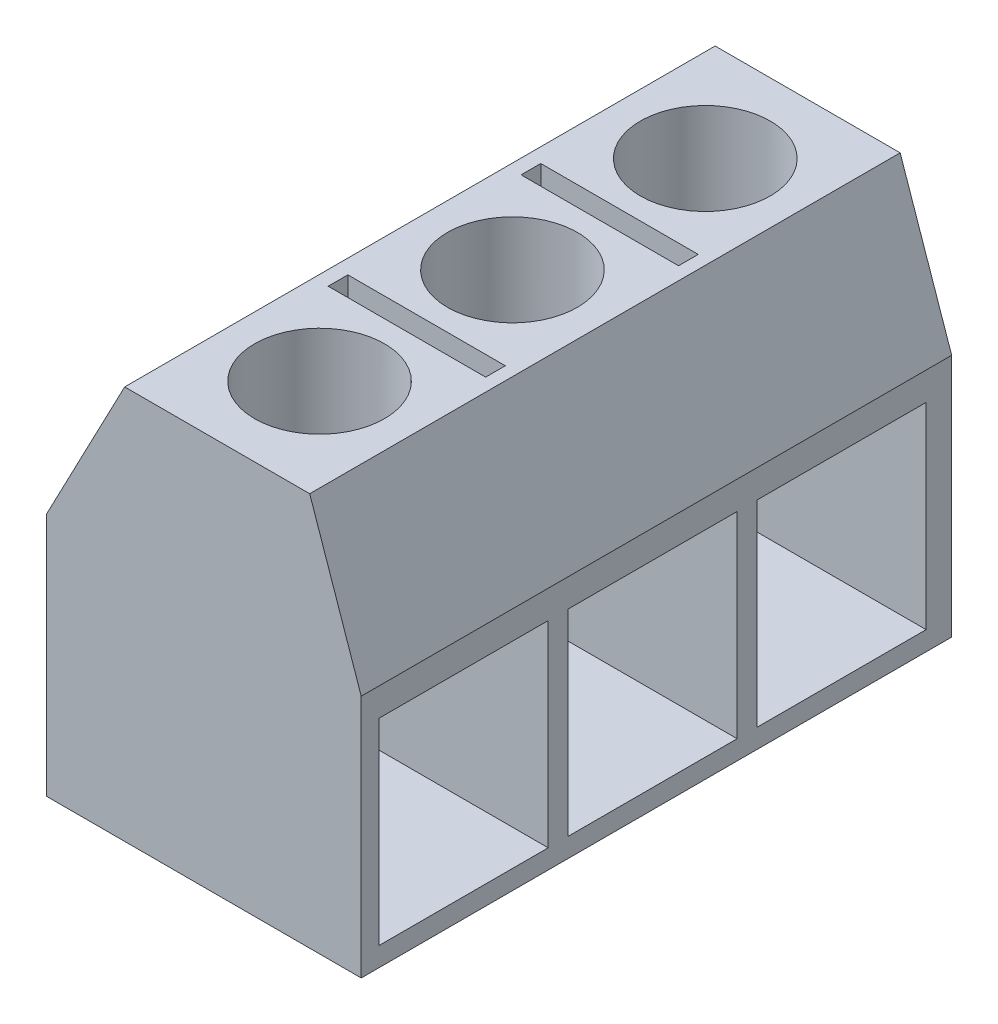
ISO-10303-21;
HEADER;
FILE_DESCRIPTION(('STEP AP214'),'2;1');
FILE_NAME('part.step','',(''),(''),'','','');
FILE_SCHEMA(('AUTOMOTIVE_DESIGN { 1 0 10303 214 1 1 1 1 }'));
ENDSEC;
DATA;
#1=APPLICATION_CONTEXT('core data for automotive mechanical design processes');
#2=APPLICATION_PROTOCOL_DEFINITION('international standard','automotive_design',2000,#1);
#3=PRODUCT_CONTEXT('',#1,'mechanical');
#4=PRODUCT('Part','Part','',(#3));
#5=PRODUCT_RELATED_PRODUCT_CATEGORY('part','',(#4));
#6=PRODUCT_DEFINITION_FORMATION('','',#4);
#7=PRODUCT_DEFINITION_CONTEXT('part definition',#1,'design');
#8=PRODUCT_DEFINITION('design','',#6,#7);
#9=PRODUCT_DEFINITION_SHAPE('','',#8);
#10=(LENGTH_UNIT() NAMED_UNIT(*) SI_UNIT(.MILLI.,.METRE.));
#11=(NAMED_UNIT(*) PLANE_ANGLE_UNIT() SI_UNIT($,.RADIAN.));
#12=(NAMED_UNIT(*) SI_UNIT($,.STERADIAN.) SOLID_ANGLE_UNIT());
#13=UNCERTAINTY_MEASURE_WITH_UNIT(LENGTH_MEASURE(1.E-05),#10,'distance_accuracy_value','');
#14=(GEOMETRIC_REPRESENTATION_CONTEXT(3) GLOBAL_UNCERTAINTY_ASSIGNED_CONTEXT((#13)) GLOBAL_UNIT_ASSIGNED_CONTEXT((#10,
#11,#12)) REPRESENTATION_CONTEXT('',''));
#15=CARTESIAN_POINT('',(0.,0.,0.));
#16=DIRECTION('',(0.,0.,1.));
#17=DIRECTION('',(1.,0.,0.));
#18=AXIS2_PLACEMENT_3D('',#15,#16,#17);
#19=CARTESIAN_POINT('',(-355.835743374389,0.,15.));
#20=DIRECTION('',(-1.,0.,0.));
#21=DIRECTION('',(0.,0.,1.));
#22=AXIS2_PLACEMENT_3D('',#19,#20,#21);
#23=PLANE('',#22);
#24=DIRECTION('',(0.,-1.,0.));
#25=VECTOR('',#24,1.);
#26=CARTESIAN_POINT('',(-355.835743374389,0.,5.45));
#27=LINE('',#26,#25);
#28=CARTESIAN_POINT('',(-355.835743374389,5.48900518216399,5.45));
#29=VERTEX_POINT('',#28);
#30=CARTESIAN_POINT('',(-355.835743374389,0.489005182163993,5.45));
#31=VERTEX_POINT('',#30);
#32=EDGE_CURVE('E63',#29,#31,#27,.T.);
#33=ORIENTED_EDGE('',*,*,#32,.T.);
#34=DIRECTION('',(0.,0.,-1.));
#35=VECTOR('',#34,1.);
#36=CARTESIAN_POINT('',(-355.835743374389,0.489005182163993,0.));
#37=LINE('',#36,#35);
#38=CARTESIAN_POINT('',(-355.835743374389,0.489005182163993,9.75));
#39=VERTEX_POINT('',#38);
#40=EDGE_CURVE('E294',#39,#31,#37,.T.);
#41=ORIENTED_EDGE('',*,*,#40,.F.);
#42=DIRECTION('',(0.,-1.,0.));
#43=VECTOR('',#42,1.);
#44=CARTESIAN_POINT('',(-355.835743374389,0.,9.75));
#45=LINE('',#44,#43);
#46=CARTESIAN_POINT('',(-355.835743374389,5.48900518216399,9.75));
#47=VERTEX_POINT('',#46);
#48=EDGE_CURVE('E313',#47,#39,#45,.T.);
#49=ORIENTED_EDGE('',*,*,#48,.F.);
#50=DIRECTION('',(0.,0.,-1.));
#51=VECTOR('',#50,1.);
#52=CARTESIAN_POINT('',(-355.835743374389,5.48900518216399,0.));
#53=LINE('',#52,#51);
#54=EDGE_CURVE('E308',#47,#29,#53,.T.);
#55=ORIENTED_EDGE('',*,*,#54,.T.);
#56=EDGE_LOOP('',(#33,#41,#49,#55));
#57=FACE_BOUND('',#56,.T.);
#58=DIRECTION('',(0.,1.,0.));
#59=VECTOR('',#58,1.);
#60=CARTESIAN_POINT('',(-355.835743374389,0.,0.));
#61=LINE('',#60,#59);
#62=CARTESIAN_POINT('',(-355.835743374389,0.,0.));
#63=VERTEX_POINT('',#62);
#64=CARTESIAN_POINT('',(-355.835743374389,6.19999999999998,0.));
#65=VERTEX_POINT('',#64);
#66=EDGE_CURVE('E529',#63,#65,#61,.T.);
#67=ORIENTED_EDGE('',*,*,#66,.T.);
#68=DIRECTION('',(0.,0.,-1.));
#69=VECTOR('',#68,1.);
#70=CARTESIAN_POINT('',(-355.835743374389,6.19999999999998,15.));
#71=LINE('',#70,#69);
#72=CARTESIAN_POINT('',(-355.835743374389,6.19999999999998,15.));
#73=VERTEX_POINT('',#72);
#74=EDGE_CURVE('E551',#73,#65,#71,.T.);
#75=ORIENTED_EDGE('',*,*,#74,.F.);
#76=DIRECTION('',(0.,1.,0.));
#77=VECTOR('',#76,1.);
#78=CARTESIAN_POINT('',(-355.835743374389,0.,15.));
#79=LINE('',#78,#77);
#80=CARTESIAN_POINT('',(-355.835743374389,0.,15.));
#81=VERTEX_POINT('',#80);
#82=EDGE_CURVE('E510',#81,#73,#79,.T.);
#83=ORIENTED_EDGE('',*,*,#82,.F.);
#84=DIRECTION('',(0.,0.,-1.));
#85=VECTOR('',#84,1.);
#86=CARTESIAN_POINT('',(-355.835743374389,0.,15.));
#87=LINE('',#86,#85);
#88=EDGE_CURVE('E555',#81,#63,#87,.T.);
#89=ORIENTED_EDGE('',*,*,#88,.T.);
#90=EDGE_LOOP('',(#67,#75,#83,#89));
#91=FACE_BOUND('',#90,.T.);
#92=DIRECTION('',(0.,-1.,0.));
#93=VECTOR('',#92,1.);
#94=CARTESIAN_POINT('',(-355.835743374389,0.,0.649999999999999));
#95=LINE('',#94,#93);
#96=CARTESIAN_POINT('',(-355.835743374389,5.48900518216399,0.650000000000001));
#97=VERTEX_POINT('',#96);
#98=CARTESIAN_POINT('',(-355.835743374389,0.489005182163993,0.65));
#99=VERTEX_POINT('',#98);
#100=EDGE_CURVE('E348',#97,#99,#95,.T.);
#101=ORIENTED_EDGE('',*,*,#100,.T.);
#102=DIRECTION('',(0.,0.,-1.));
#103=VECTOR('',#102,1.);
#104=CARTESIAN_POINT('',(-355.835743374389,0.489005182163993,0.));
#105=LINE('',#104,#103);
#106=CARTESIAN_POINT('',(-355.835743374389,0.489005182163993,4.95));
#107=VERTEX_POINT('',#106);
#108=EDGE_CURVE('E336',#107,#99,#105,.T.);
#109=ORIENTED_EDGE('',*,*,#108,.F.);
#110=DIRECTION('',(0.,-1.,0.));
#111=VECTOR('',#110,1.);
#112=CARTESIAN_POINT('',(-355.835743374389,0.,4.95));
#113=LINE('',#112,#111);
#114=CARTESIAN_POINT('',(-355.835743374389,5.48900518216399,4.95));
#115=VERTEX_POINT('',#114);
#116=EDGE_CURVE('E356',#115,#107,#113,.T.);
#117=ORIENTED_EDGE('',*,*,#116,.F.);
#118=DIRECTION('',(0.,0.,-1.));
#119=VECTOR('',#118,1.);
#120=CARTESIAN_POINT('',(-355.835743374389,5.48900518216399,0.));
#121=LINE('',#120,#119);
#122=EDGE_CURVE('E352',#115,#97,#121,.T.);
#123=ORIENTED_EDGE('',*,*,#122,.T.);
#124=EDGE_LOOP('',(#101,#109,#117,#123));
#125=FACE_BOUND('',#124,.T.);
#126=DIRECTION('',(0.,-1.,0.));
#127=VECTOR('',#126,1.);
#128=CARTESIAN_POINT('',(-355.835743374389,0.,10.25));
#129=LINE('',#128,#127);
#130=CARTESIAN_POINT('',(-355.835743374389,5.48900518216399,10.25));
#131=VERTEX_POINT('',#130);
#132=CARTESIAN_POINT('',(-355.835743374389,0.489005182163993,10.25));
#133=VERTEX_POINT('',#132);
#134=EDGE_CURVE('E55',#131,#133,#129,.T.);
#135=ORIENTED_EDGE('',*,*,#134,.T.);
#136=DIRECTION('',(0.,0.,-1.));
#137=VECTOR('',#136,1.);
#138=CARTESIAN_POINT('',(-355.835743374389,0.489005182163993,0.));
#139=LINE('',#138,#137);
#140=CARTESIAN_POINT('',(-355.835743374389,0.489005182163993,14.55));
#141=VERTEX_POINT('',#140);
#142=EDGE_CURVE('E261',#141,#133,#139,.T.);
#143=ORIENTED_EDGE('',*,*,#142,.F.);
#144=DIRECTION('',(0.,-1.,0.));
#145=VECTOR('',#144,1.);
#146=CARTESIAN_POINT('',(-355.835743374389,0.,14.55));
#147=LINE('',#146,#145);
#148=CARTESIAN_POINT('',(-355.835743374389,5.48900518216399,14.55));
#149=VERTEX_POINT('',#148);
#150=EDGE_CURVE('E265',#149,#141,#147,.T.);
#151=ORIENTED_EDGE('',*,*,#150,.F.);
#152=DIRECTION('',(0.,0.,-1.));
#153=VECTOR('',#152,1.);
#154=CARTESIAN_POINT('',(-355.835743374389,5.489005182164,0.));
#155=LINE('',#154,#153);
#156=EDGE_CURVE('E274',#149,#131,#155,.T.);
#157=ORIENTED_EDGE('',*,*,#156,.T.);
#158=EDGE_LOOP('',(#135,#143,#151,#157));
#159=FACE_BOUND('',#158,.T.);
#160=ADVANCED_FACE('F39',(#57,#91,#125,#159),#23,.F.);
#161=CARTESIAN_POINT('',(-357.47498496997,0.8,9.7));
#162=DIRECTION('',(0.,0.,-1.));
#163=DIRECTION('',(-1.,0.,0.));
#164=AXIS2_PLACEMENT_3D('',#161,#162,#163);
#165=PLANE('',#164);
#166=DIRECTION('',(-1.,0.,0.));
#167=VECTOR('',#166,1.);
#168=CARTESIAN_POINT('',(-357.47498496997,5.48900518216399,9.7));
#169=LINE('',#168,#167);
#170=CARTESIAN_POINT('',(-357.47498496997,5.48900518216399,9.7));
#171=VERTEX_POINT('',#170);
#172=CARTESIAN_POINT('',(-361.47498496997,5.48900518216399,9.7));
#173=VERTEX_POINT('',#172);
#174=EDGE_CURVE('E394',#171,#173,#169,.T.);
#175=ORIENTED_EDGE('',*,*,#174,.F.);
#176=DIRECTION('',(0.,1.,0.));
#177=VECTOR('',#176,1.);
#178=CARTESIAN_POINT('',(-357.47498496997,0.8,9.7));
#179=LINE('',#178,#177);
#180=CARTESIAN_POINT('',(-357.47498496997,9.99999999999992,9.7));
#181=VERTEX_POINT('',#180);
#182=EDGE_CURVE('E465',#171,#181,#179,.T.);
#183=ORIENTED_EDGE('',*,*,#182,.T.);
#184=DIRECTION('',(-1.,0.,0.));
#185=VECTOR('',#184,1.);
#186=CARTESIAN_POINT('',(-357.47498496997,10.,9.7));
#187=LINE('',#186,#185);
#188=CARTESIAN_POINT('',(-361.47498496997,10.,9.7));
#189=VERTEX_POINT('',#188);
#190=EDGE_CURVE('E486',#181,#189,#187,.T.);
#191=ORIENTED_EDGE('',*,*,#190,.T.);
#192=DIRECTION('',(0.,1.,0.));
#193=VECTOR('',#192,1.);
#194=CARTESIAN_POINT('',(-361.47498496997,0.8,9.7));
#195=LINE('',#194,#193);
#196=EDGE_CURVE('E469',#173,#189,#195,.T.);
#197=ORIENTED_EDGE('',*,*,#196,.F.);
#198=EDGE_LOOP('',(#175,#183,#191,#197));
#199=FACE_BOUND('',#198,.T.);
#200=ADVANCED_FACE('F577',(#199),#165,.F.);
#201=CARTESIAN_POINT('',(-359.494738602923,0.8,12.4));
#202=DIRECTION('',(0.,1.,0.));
#203=DIRECTION('',(0.,0.,1.));
#204=AXIS2_PLACEMENT_3D('',#201,#202,#203);
#205=CYLINDRICAL_SURFACE('',#204,1.64999999999999);
#206=CARTESIAN_POINT('',(-359.494738602923,10.,12.4));
#207=DIRECTION('',(0.,1.,0.));
#208=DIRECTION('',(0.,0.,1.));
#209=AXIS2_PLACEMENT_3D('',#206,#207,#208);
#210=CIRCLE('',#209,1.64999999999999);
#211=CARTESIAN_POINT('',(-359.494738602923,10.,14.05));
#212=VERTEX_POINT('',#211);
#213=EDGE_CURVE('E460',#212,#212,#210,.T.);
#214=ORIENTED_EDGE('',*,*,#213,.T.);
#215=EDGE_LOOP('',(#214));
#216=FACE_BOUND('',#215,.T.);
#217=CARTESIAN_POINT('',(-359.494738602923,5.48900518216399,12.4));
#218=DIRECTION('',(0.,-1.,0.));
#219=DIRECTION('',(0.,0.,-1.));
#220=AXIS2_PLACEMENT_3D('',#217,#218,#219);
#221=CIRCLE('',#220,1.64999999999999);
#222=CARTESIAN_POINT('',(-359.494738602923,5.48900518216399,10.75));
#223=VERTEX_POINT('',#222);
#224=EDGE_CURVE('E404',#223,#223,#221,.F.);
#225=ORIENTED_EDGE('',*,*,#224,.F.);
#226=EDGE_LOOP('',(#225));
#227=FACE_BOUND('',#226,.T.);
#228=ADVANCED_FACE('F574',(#216,#227),#205,.F.);
#229=CARTESIAN_POINT('',(-359.494738602923,0.8,7.5));
#230=DIRECTION('',(0.,1.,0.));
#231=DIRECTION('',(0.,0.,1.));
#232=AXIS2_PLACEMENT_3D('',#229,#230,#231);
#233=CYLINDRICAL_SURFACE('',#232,1.64999999999999);
#234=CARTESIAN_POINT('',(-359.494738602923,10.,7.5));
#235=DIRECTION('',(0.,1.,0.));
#236=DIRECTION('',(0.,0.,1.));
#237=AXIS2_PLACEMENT_3D('',#234,#235,#236);
#238=CIRCLE('',#237,1.64999999999999);
#239=CARTESIAN_POINT('',(-359.494738602923,10.,9.14999999999999));
#240=VERTEX_POINT('',#239);
#241=EDGE_CURVE('E432',#240,#240,#238,.F.);
#242=ORIENTED_EDGE('',*,*,#241,.F.);
#243=EDGE_LOOP('',(#242));
#244=FACE_BOUND('',#243,.T.);
#245=CARTESIAN_POINT('',(-359.494738602923,5.48900518216399,7.5));
#246=DIRECTION('',(0.,-1.,0.));
#247=DIRECTION('',(0.,0.,-1.));
#248=AXIS2_PLACEMENT_3D('',#245,#246,#247);
#249=CIRCLE('',#248,1.64999999999999);
#250=CARTESIAN_POINT('',(-359.494738602923,5.48900518216399,5.85000000000001));
#251=VERTEX_POINT('',#250);
#252=EDGE_CURVE('E393',#251,#251,#249,.T.);
#253=ORIENTED_EDGE('',*,*,#252,.T.);
#254=EDGE_LOOP('',(#253));
#255=FACE_BOUND('',#254,.T.);
#256=ADVANCED_FACE('F576',(#244,#255),#233,.F.);
#257=CARTESIAN_POINT('',(0.,0.8,4.79999999999992));
#258=DIRECTION('',(0.,0.,-1.));
#259=DIRECTION('',(-1.,0.,0.));
#260=AXIS2_PLACEMENT_3D('',#257,#258,#259);
#261=PLANE('',#260);
#262=DIRECTION('',(-1.,0.,0.));
#263=VECTOR('',#262,1.);
#264=CARTESIAN_POINT('',(0.,5.48900518216399,4.79999999999992));
#265=LINE('',#264,#263);
#266=CARTESIAN_POINT('',(-357.47498496997,5.48900518216399,4.8));
#267=VERTEX_POINT('',#266);
#268=CARTESIAN_POINT('',(-361.47498496997,5.48900518216399,4.8));
#269=VERTEX_POINT('',#268);
#270=EDGE_CURVE('E379',#267,#269,#265,.T.);
#271=ORIENTED_EDGE('',*,*,#270,.F.);
#272=DIRECTION('',(0.,1.,0.));
#273=VECTOR('',#272,1.);
#274=CARTESIAN_POINT('',(-357.47498496997,0.8,4.8));
#275=LINE('',#274,#273);
#276=CARTESIAN_POINT('',(-357.47498496997,10.,4.8));
#277=VERTEX_POINT('',#276);
#278=EDGE_CURVE('E429',#267,#277,#275,.T.);
#279=ORIENTED_EDGE('',*,*,#278,.T.);
#280=DIRECTION('',(-1.,0.,0.));
#281=VECTOR('',#280,1.);
#282=CARTESIAN_POINT('',(0.,10.,4.79999999999992));
#283=LINE('',#282,#281);
#284=CARTESIAN_POINT('',(-361.47498496997,9.99999999999992,4.8));
#285=VERTEX_POINT('',#284);
#286=EDGE_CURVE('E418',#277,#285,#283,.T.);
#287=ORIENTED_EDGE('',*,*,#286,.T.);
#288=DIRECTION('',(0.,1.,0.));
#289=VECTOR('',#288,1.);
#290=CARTESIAN_POINT('',(-361.47498496997,0.8,4.8));
#291=LINE('',#290,#289);
#292=EDGE_CURVE('E419',#269,#285,#291,.T.);
#293=ORIENTED_EDGE('',*,*,#292,.F.);
#294=EDGE_LOOP('',(#271,#279,#287,#293));
#295=FACE_BOUND('',#294,.T.);
#296=ADVANCED_FACE('F584',(#295),#261,.F.);
#297=CARTESIAN_POINT('',(-359.494738602923,0.8,2.6));
#298=DIRECTION('',(0.,1.,0.));
#299=DIRECTION('',(0.,0.,1.));
#300=AXIS2_PLACEMENT_3D('',#297,#298,#299);
#301=CYLINDRICAL_SURFACE('',#300,1.64999999999999);
#302=CARTESIAN_POINT('',(-359.494738602923,10.,2.6));
#303=DIRECTION('',(0.,1.,0.));
#304=DIRECTION('',(0.,0.,1.));
#305=AXIS2_PLACEMENT_3D('',#302,#303,#304);
#306=CIRCLE('',#305,1.64999999999999);
#307=CARTESIAN_POINT('',(-359.494738602923,10.,4.24999999999999));
#308=VERTEX_POINT('',#307);
#309=EDGE_CURVE('E413',#308,#308,#306,.T.);
#310=ORIENTED_EDGE('',*,*,#309,.T.);
#311=EDGE_LOOP('',(#310));
#312=FACE_BOUND('',#311,.T.);
#313=CARTESIAN_POINT('',(-359.494738602923,5.48900518216399,2.6));
#314=DIRECTION('',(0.,-1.,0.));
#315=DIRECTION('',(0.,0.,-1.));
#316=AXIS2_PLACEMENT_3D('',#313,#314,#315);
#317=CIRCLE('',#316,1.64999999999999);
#318=CARTESIAN_POINT('',(-359.494738602923,5.48900518216399,0.950000000000013));
#319=VERTEX_POINT('',#318);
#320=EDGE_CURVE('E284',#319,#319,#317,.F.);
#321=ORIENTED_EDGE('',*,*,#320,.F.);
#322=EDGE_LOOP('',(#321));
#323=FACE_BOUND('',#322,.T.);
#324=ADVANCED_FACE('F642',(#312,#323),#301,.F.);
#325=CARTESIAN_POINT('',(-357.144738602923,9.99999999999992,15.));
#326=DIRECTION('',(0.,-1.,0.));
#327=DIRECTION('',(1.,0.,0.));
#328=AXIS2_PLACEMENT_3D('',#325,#326,#327);
#329=PLANE('',#328);
#330=ORIENTED_EDGE('',*,*,#309,.F.);
#331=EDGE_LOOP('',(#330));
#332=FACE_BOUND('',#331,.T.);
#333=DIRECTION('',(0.,0.,1.));
#334=VECTOR('',#333,1.);
#335=CARTESIAN_POINT('',(-361.47498496997,10.,0.));
#336=LINE('',#335,#334);
#337=CARTESIAN_POINT('',(-361.47498496997,10.,5.3));
#338=VERTEX_POINT('',#337);
#339=EDGE_CURVE('E442',#285,#338,#336,.T.);
#340=ORIENTED_EDGE('',*,*,#339,.F.);
#341=ORIENTED_EDGE('',*,*,#286,.F.);
#342=DIRECTION('',(0.,0.,1.));
#343=VECTOR('',#342,1.);
#344=CARTESIAN_POINT('',(-357.47498496997,10.,0.));
#345=LINE('',#344,#343);
#346=CARTESIAN_POINT('',(-357.47498496997,10.,5.3));
#347=VERTEX_POINT('',#346);
#348=EDGE_CURVE('E433',#277,#347,#345,.T.);
#349=ORIENTED_EDGE('',*,*,#348,.T.);
#350=DIRECTION('',(-1.,0.,0.));
#351=VECTOR('',#350,1.);
#352=CARTESIAN_POINT('',(0.,10.,5.29999999999992));
#353=LINE('',#352,#351);
#354=EDGE_CURVE('E437',#347,#338,#353,.T.);
#355=ORIENTED_EDGE('',*,*,#354,.T.);
#356=EDGE_LOOP('',(#340,#341,#349,#355));
#357=FACE_BOUND('',#356,.T.);
#358=ORIENTED_EDGE('',*,*,#213,.F.);
#359=EDGE_LOOP('',(#358));
#360=FACE_BOUND('',#359,.T.);
#361=ORIENTED_EDGE('',*,*,#190,.F.);
#362=DIRECTION('',(0.,0.,-1.));
#363=VECTOR('',#362,1.);
#364=CARTESIAN_POINT('',(-357.47498496997,10.,10.2));
#365=LINE('',#364,#363);
#366=CARTESIAN_POINT('',(-357.47498496997,10.,10.2));
#367=VERTEX_POINT('',#366);
#368=EDGE_CURVE('E464',#367,#181,#365,.T.);
#369=ORIENTED_EDGE('',*,*,#368,.F.);
#370=DIRECTION('',(-1.,0.,0.));
#371=VECTOR('',#370,1.);
#372=CARTESIAN_POINT('',(-357.47498496997,10.,10.2));
#373=LINE('',#372,#371);
#374=CARTESIAN_POINT('',(-361.47498496997,10.,10.2));
#375=VERTEX_POINT('',#374);
#376=EDGE_CURVE('E477',#367,#375,#373,.T.);
#377=ORIENTED_EDGE('',*,*,#376,.T.);
#378=DIRECTION('',(0.,0.,-1.));
#379=VECTOR('',#378,1.);
#380=CARTESIAN_POINT('',(-361.47498496997,10.,10.2));
#381=LINE('',#380,#379);
#382=EDGE_CURVE('E481',#375,#189,#381,.T.);
#383=ORIENTED_EDGE('',*,*,#382,.T.);
#384=EDGE_LOOP('',(#361,#369,#377,#383));
#385=FACE_BOUND('',#384,.T.);
#386=DIRECTION('',(-1.,0.,0.));
#387=VECTOR('',#386,1.);
#388=CARTESIAN_POINT('',(-357.144738602923,9.99999999999992,0.));
#389=LINE('',#388,#387);
#390=CARTESIAN_POINT('',(-357.144738602923,9.99999999999992,0.));
#391=VERTEX_POINT('',#390);
#392=CARTESIAN_POINT('',(-361.844738602923,9.99999999999992,0.));
#393=VERTEX_POINT('',#392);
#394=EDGE_CURVE('E535',#391,#393,#389,.T.);
#395=ORIENTED_EDGE('',*,*,#394,.T.);
#396=DIRECTION('',(0.,0.,-1.));
#397=VECTOR('',#396,1.);
#398=CARTESIAN_POINT('',(-361.844738602923,9.99999999999992,15.));
#399=LINE('',#398,#397);
#400=CARTESIAN_POINT('',(-361.844738602923,9.99999999999992,15.));
#401=VERTEX_POINT('',#400);
#402=EDGE_CURVE('E543',#401,#393,#399,.T.);
#403=ORIENTED_EDGE('',*,*,#402,.F.);
#404=DIRECTION('',(-1.,0.,0.));
#405=VECTOR('',#404,1.);
#406=CARTESIAN_POINT('',(-357.144738602923,9.99999999999992,15.));
#407=LINE('',#406,#405);
#408=CARTESIAN_POINT('',(-357.144738602923,9.99999999999992,15.));
#409=VERTEX_POINT('',#408);
#410=EDGE_CURVE('E516',#409,#401,#407,.T.);
#411=ORIENTED_EDGE('',*,*,#410,.F.);
#412=DIRECTION('',(0.,0.,-1.));
#413=VECTOR('',#412,1.);
#414=CARTESIAN_POINT('',(-357.144738602923,9.99999999999992,15.));
#415=LINE('',#414,#413);
#416=EDGE_CURVE('E547',#409,#391,#415,.T.);
#417=ORIENTED_EDGE('',*,*,#416,.T.);
#418=EDGE_LOOP('',(#395,#403,#411,#417));
#419=FACE_BOUND('',#418,.T.);
#420=ORIENTED_EDGE('',*,*,#241,.T.);
#421=EDGE_LOOP('',(#420));
#422=FACE_BOUND('',#421,.T.);
#423=ADVANCED_FACE('F608',(#332,#357,#360,#385,#419,#422),#329,.F.);
#424=CARTESIAN_POINT('',(-363.835743374389,6.19999999999998,15.));
#425=DIRECTION('',(1.,0.,0.));
#426=DIRECTION('',(0.,1.,0.));
#427=AXIS2_PLACEMENT_3D('',#424,#425,#426);
#428=PLANE('',#427);
#429=DIRECTION('',(0.,-1.,0.));
#430=VECTOR('',#429,1.);
#431=CARTESIAN_POINT('',(-363.835743374389,6.19999999999998,0.));
#432=LINE('',#431,#430);
#433=CARTESIAN_POINT('',(-363.835743374389,6.19999999999998,0.));
#434=VERTEX_POINT('',#433);
#435=CARTESIAN_POINT('',(-363.835743374389,0.,0.));
#436=VERTEX_POINT('',#435);
#437=EDGE_CURVE('E417',#434,#436,#432,.T.);
#438=ORIENTED_EDGE('',*,*,#437,.T.);
#439=DIRECTION('',(0.,0.,-1.));
#440=VECTOR('',#439,1.);
#441=CARTESIAN_POINT('',(-363.835743374389,0.,15.));
#442=LINE('',#441,#440);
#443=CARTESIAN_POINT('',(-363.835743374389,0.,15.));
#444=VERTEX_POINT('',#443);
#445=EDGE_CURVE('E559',#444,#436,#442,.T.);
#446=ORIENTED_EDGE('',*,*,#445,.F.);
#447=DIRECTION('',(0.,-1.,0.));
#448=VECTOR('',#447,1.);
#449=CARTESIAN_POINT('',(-363.835743374389,6.19999999999998,15.));
#450=LINE('',#449,#448);
#451=CARTESIAN_POINT('',(-363.835743374389,6.19999999999998,15.));
#452=VERTEX_POINT('',#451);
#453=EDGE_CURVE('E502',#452,#444,#450,.T.);
#454=ORIENTED_EDGE('',*,*,#453,.F.);
#455=DIRECTION('',(0.,0.,-1.));
#456=VECTOR('',#455,1.);
#457=CARTESIAN_POINT('',(-363.835743374389,6.19999999999998,15.));
#458=LINE('',#457,#456);
#459=EDGE_CURVE('E522',#452,#434,#458,.T.);
#460=ORIENTED_EDGE('',*,*,#459,.T.);
#461=EDGE_LOOP('',(#438,#446,#454,#460));
#462=FACE_BOUND('',#461,.T.);
#463=ADVANCED_FACE('F41',(#462),#428,.F.);
#464=CARTESIAN_POINT('',(-363.835743374389,0.,15.));
#465=DIRECTION('',(0.,1.,0.));
#466=DIRECTION('',(0.,0.,1.));
#467=AXIS2_PLACEMENT_3D('',#464,#465,#466);
#468=PLANE('',#467);
#469=DIRECTION('',(1.,0.,0.));
#470=VECTOR('',#469,1.);
#471=CARTESIAN_POINT('',(-363.835743374389,0.,0.));
#472=LINE('',#471,#470);
#473=EDGE_CURVE('E526',#436,#63,#472,.T.);
#474=ORIENTED_EDGE('',*,*,#473,.T.);
#475=ORIENTED_EDGE('',*,*,#88,.F.);
#476=DIRECTION('',(1.,0.,0.));
#477=VECTOR('',#476,1.);
#478=CARTESIAN_POINT('',(-363.835743374389,0.,15.));
#479=LINE('',#478,#477);
#480=EDGE_CURVE('E506',#444,#81,#479,.T.);
#481=ORIENTED_EDGE('',*,*,#480,.F.);
#482=ORIENTED_EDGE('',*,*,#445,.T.);
#483=EDGE_LOOP('',(#474,#475,#481,#482));
#484=FACE_BOUND('',#483,.T.);
#485=ADVANCED_FACE('F599',(#484),#468,.F.);
#486=CARTESIAN_POINT('',(-355.835743374389,6.19999999999998,15.));
#487=DIRECTION('',(-0.945476419668404,-0.325690558430875,0.));
#488=DIRECTION('',(0.325690558430875,-0.945476419668405,0.));
#489=AXIS2_PLACEMENT_3D('',#486,#487,#488);
#490=PLANE('',#489);
#491=DIRECTION('',(-0.325690558430875,0.945476419668404,0.));
#492=VECTOR('',#491,1.);
#493=CARTESIAN_POINT('',(-355.835743374389,6.19999999999998,0.));
#494=LINE('',#493,#492);
#495=EDGE_CURVE('E532',#65,#391,#494,.T.);
#496=ORIENTED_EDGE('',*,*,#495,.T.);
#497=ORIENTED_EDGE('',*,*,#416,.F.);
#498=DIRECTION('',(-0.325690558430875,0.945476419668404,0.));
#499=VECTOR('',#498,1.);
#500=CARTESIAN_POINT('',(-355.835743374389,6.19999999999998,15.));
#501=LINE('',#500,#499);
#502=EDGE_CURVE('E513',#73,#409,#501,.T.);
#503=ORIENTED_EDGE('',*,*,#502,.F.);
#504=ORIENTED_EDGE('',*,*,#74,.T.);
#505=EDGE_LOOP('',(#496,#497,#503,#504));
#506=FACE_BOUND('',#505,.T.);
#507=ADVANCED_FACE('F597',(#506),#490,.F.);
#508=CARTESIAN_POINT('',(-361.844738602923,9.99999999999992,15.));
#509=DIRECTION('',(0.885780885780871,-0.464103676332406,0.));
#510=DIRECTION('',(0.464103676332406,0.885780885780872,0.));
#511=AXIS2_PLACEMENT_3D('',#508,#509,#510);
#512=PLANE('',#511);
#513=DIRECTION('',(-0.464103676332406,-0.885780885780872,0.));
#514=VECTOR('',#513,1.);
#515=CARTESIAN_POINT('',(-361.844738602923,9.99999999999992,0.));
#516=LINE('',#515,#514);
#517=EDGE_CURVE('E507',#393,#434,#516,.T.);
#518=ORIENTED_EDGE('',*,*,#517,.T.);
#519=ORIENTED_EDGE('',*,*,#459,.F.);
#520=DIRECTION('',(-0.464103676332406,-0.885780885780872,0.));
#521=VECTOR('',#520,1.);
#522=CARTESIAN_POINT('',(-361.844738602923,9.99999999999992,15.));
#523=LINE('',#522,#521);
#524=EDGE_CURVE('E519',#401,#452,#523,.T.);
#525=ORIENTED_EDGE('',*,*,#524,.F.);
#526=ORIENTED_EDGE('',*,*,#402,.T.);
#527=EDGE_LOOP('',(#518,#519,#525,#526));
#528=FACE_BOUND('',#527,.T.);
#529=ADVANCED_FACE('F606',(#528),#512,.F.);
#530=CARTESIAN_POINT('',(0.,0.,15.));
#531=DIRECTION('',(0.,0.,1.));
#532=DIRECTION('',(1.,0.,0.));
#533=AXIS2_PLACEMENT_3D('',#530,#531,#532);
#534=PLANE('',#533);
#535=ORIENTED_EDGE('',*,*,#453,.T.);
#536=ORIENTED_EDGE('',*,*,#480,.T.);
#537=ORIENTED_EDGE('',*,*,#82,.T.);
#538=ORIENTED_EDGE('',*,*,#502,.T.);
#539=ORIENTED_EDGE('',*,*,#410,.T.);
#540=ORIENTED_EDGE('',*,*,#524,.T.);
#541=EDGE_LOOP('',(#535,#536,#537,#538,#539,#540));
#542=FACE_BOUND('',#541,.T.);
#543=ADVANCED_FACE('F630',(#542),#534,.T.);
#544=CARTESIAN_POINT('',(0.,0.,0.));
#545=DIRECTION('',(0.,0.,1.));
#546=DIRECTION('',(1.,0.,0.));
#547=AXIS2_PLACEMENT_3D('',#544,#545,#546);
#548=PLANE('',#547);
#549=ORIENTED_EDGE('',*,*,#437,.F.);
#550=ORIENTED_EDGE('',*,*,#517,.F.);
#551=ORIENTED_EDGE('',*,*,#394,.F.);
#552=ORIENTED_EDGE('',*,*,#495,.F.);
#553=ORIENTED_EDGE('',*,*,#66,.F.);
#554=ORIENTED_EDGE('',*,*,#473,.F.);
#555=EDGE_LOOP('',(#549,#550,#551,#552,#553,#554));
#556=FACE_BOUND('',#555,.T.);
#557=ADVANCED_FACE('F619',(#556),#548,.F.);
#558=CARTESIAN_POINT('',(-357.47498496997,0.8,10.2));
#559=DIRECTION('',(1.,0.,0.));
#560=DIRECTION('',(0.,0.,-1.));
#561=AXIS2_PLACEMENT_3D('',#558,#559,#560);
#562=PLANE('',#561);
#563=DIRECTION('',(0.,0.,-1.));
#564=VECTOR('',#563,1.);
#565=CARTESIAN_POINT('',(-357.47498496997,5.48900518216399,10.2));
#566=LINE('',#565,#564);
#567=CARTESIAN_POINT('',(-357.47498496997,5.48900518216399,9.75));
#568=VERTEX_POINT('',#567);
#569=EDGE_CURVE('E401',#568,#171,#566,.T.);
#570=ORIENTED_EDGE('',*,*,#569,.F.);
#571=DIRECTION('',(0.,-1.,0.));
#572=VECTOR('',#571,1.);
#573=CARTESIAN_POINT('',(-357.47498496997,0.8,9.75));
#574=LINE('',#573,#572);
#575=CARTESIAN_POINT('',(-357.47498496997,0.8,9.75));
#576=VERTEX_POINT('',#575);
#577=EDGE_CURVE('E408',#568,#576,#574,.T.);
#578=ORIENTED_EDGE('',*,*,#577,.T.);
#579=DIRECTION('',(0.,0.,-1.));
#580=VECTOR('',#579,1.);
#581=CARTESIAN_POINT('',(-357.47498496997,0.8,10.2));
#582=LINE('',#581,#580);
#583=CARTESIAN_POINT('',(-357.47498496997,0.8,10.2));
#584=VERTEX_POINT('',#583);
#585=EDGE_CURVE('E482',#584,#576,#582,.T.);
#586=ORIENTED_EDGE('',*,*,#585,.F.);
#587=DIRECTION('',(0.,1.,0.));
#588=VECTOR('',#587,1.);
#589=CARTESIAN_POINT('',(-357.47498496997,0.8,10.2));
#590=LINE('',#589,#588);
#591=EDGE_CURVE('E412',#584,#367,#590,.T.);
#592=ORIENTED_EDGE('',*,*,#591,.T.);
#593=ORIENTED_EDGE('',*,*,#368,.T.);
#594=ORIENTED_EDGE('',*,*,#182,.F.);
#595=EDGE_LOOP('',(#570,#578,#586,#592,#593,#594));
#596=FACE_BOUND('',#595,.T.);
#597=ADVANCED_FACE('F664',(#596),#562,.F.);
#598=CARTESIAN_POINT('',(-357.47498496997,0.8,10.2));
#599=DIRECTION('',(0.,0.,-1.));
#600=DIRECTION('',(-1.,0.,0.));
#601=AXIS2_PLACEMENT_3D('',#598,#599,#600);
#602=PLANE('',#601);
#603=ORIENTED_EDGE('',*,*,#376,.F.);
#604=ORIENTED_EDGE('',*,*,#591,.F.);
#605=DIRECTION('',(-1.,0.,0.));
#606=VECTOR('',#605,1.);
#607=CARTESIAN_POINT('',(-357.47498496997,0.8,10.2));
#608=LINE('',#607,#606);
#609=CARTESIAN_POINT('',(-361.47498496997,0.8,10.2));
#610=VERTEX_POINT('',#609);
#611=EDGE_CURVE('E468',#584,#610,#608,.T.);
#612=ORIENTED_EDGE('',*,*,#611,.T.);
#613=DIRECTION('',(0.,1.,0.));
#614=VECTOR('',#613,1.);
#615=CARTESIAN_POINT('',(-361.47498496997,0.8,10.2));
#616=LINE('',#615,#614);
#617=EDGE_CURVE('E472',#610,#375,#616,.T.);
#618=ORIENTED_EDGE('',*,*,#617,.T.);
#619=EDGE_LOOP('',(#603,#604,#612,#618));
#620=FACE_BOUND('',#619,.T.);
#621=ADVANCED_FACE('F669',(#620),#602,.T.);
#622=CARTESIAN_POINT('',(-361.47498496997,0.8,10.2));
#623=DIRECTION('',(1.,0.,0.));
#624=DIRECTION('',(0.,0.,-1.));
#625=AXIS2_PLACEMENT_3D('',#622,#623,#624);
#626=PLANE('',#625);
#627=DIRECTION('',(0.,-1.,0.));
#628=VECTOR('',#627,1.);
#629=CARTESIAN_POINT('',(-361.47498496997,0.8,9.75));
#630=LINE('',#629,#628);
#631=CARTESIAN_POINT('',(-361.47498496997,5.48900518216399,9.75));
#632=VERTEX_POINT('',#631);
#633=CARTESIAN_POINT('',(-361.47498496997,0.8,9.75));
#634=VERTEX_POINT('',#633);
#635=EDGE_CURVE('E405',#632,#634,#630,.T.);
#636=ORIENTED_EDGE('',*,*,#635,.F.);
#637=DIRECTION('',(0.,0.,-1.));
#638=VECTOR('',#637,1.);
#639=CARTESIAN_POINT('',(-361.47498496997,5.48900518216399,10.2));
#640=LINE('',#639,#638);
#641=EDGE_CURVE('E397',#632,#173,#640,.T.);
#642=ORIENTED_EDGE('',*,*,#641,.T.);
#643=ORIENTED_EDGE('',*,*,#196,.T.);
#644=ORIENTED_EDGE('',*,*,#382,.F.);
#645=ORIENTED_EDGE('',*,*,#617,.F.);
#646=DIRECTION('',(0.,0.,-1.));
#647=VECTOR('',#646,1.);
#648=CARTESIAN_POINT('',(-361.47498496997,0.8,10.2));
#649=LINE('',#648,#647);
#650=EDGE_CURVE('E495',#610,#634,#649,.T.);
#651=ORIENTED_EDGE('',*,*,#650,.T.);
#652=EDGE_LOOP('',(#636,#642,#643,#644,#645,#651));
#653=FACE_BOUND('',#652,.T.);
#654=ADVANCED_FACE('F674',(#653),#626,.T.);
#655=CARTESIAN_POINT('',(0.,0.8,0.));
#656=DIRECTION('',(0.,1.,0.));
#657=DIRECTION('',(0.,0.,1.));
#658=AXIS2_PLACEMENT_3D('',#655,#656,#657);
#659=PLANE('',#658);
#660=DIRECTION('',(1.,0.,0.));
#661=VECTOR('',#660,1.);
#662=CARTESIAN_POINT('',(0.,0.8,9.75));
#663=LINE('',#662,#661);
#664=EDGE_CURVE('E11',#634,#576,#663,.T.);
#665=ORIENTED_EDGE('',*,*,#664,.F.);
#666=ORIENTED_EDGE('',*,*,#650,.F.);
#667=ORIENTED_EDGE('',*,*,#611,.F.);
#668=ORIENTED_EDGE('',*,*,#585,.T.);
#669=EDGE_LOOP('',(#665,#666,#667,#668));
#670=FACE_BOUND('',#669,.T.);
#671=ADVANCED_FACE('F744',(#670),#659,.T.);
#672=CARTESIAN_POINT('',(-357.47498496997,0.8,0.));
#673=DIRECTION('',(-1.,0.,0.));
#674=DIRECTION('',(0.,0.,1.));
#675=AXIS2_PLACEMENT_3D('',#672,#673,#674);
#676=PLANE('',#675);
#677=DIRECTION('',(0.,1.,0.));
#678=VECTOR('',#677,1.);
#679=CARTESIAN_POINT('',(-357.47498496997,0.8,4.95));
#680=LINE('',#679,#678);
#681=CARTESIAN_POINT('',(-357.47498496997,0.8,4.95));
#682=VERTEX_POINT('',#681);
#683=CARTESIAN_POINT('',(-357.47498496997,5.48900518216399,4.95));
#684=VERTEX_POINT('',#683);
#685=EDGE_CURVE('E390',#682,#684,#680,.T.);
#686=ORIENTED_EDGE('',*,*,#685,.F.);
#687=DIRECTION('',(0.,0.,1.));
#688=VECTOR('',#687,1.);
#689=CARTESIAN_POINT('',(-357.47498496997,0.8,0.));
#690=LINE('',#689,#688);
#691=CARTESIAN_POINT('',(-357.47498496997,0.8,5.3));
#692=VERTEX_POINT('',#691);
#693=EDGE_CURVE('E422',#682,#692,#690,.T.);
#694=ORIENTED_EDGE('',*,*,#693,.T.);
#695=DIRECTION('',(0.,1.,0.));
#696=VECTOR('',#695,1.);
#697=CARTESIAN_POINT('',(-357.47498496997,0.8,5.3));
#698=LINE('',#697,#696);
#699=EDGE_CURVE('E426',#692,#347,#698,.T.);
#700=ORIENTED_EDGE('',*,*,#699,.T.);
#701=ORIENTED_EDGE('',*,*,#348,.F.);
#702=ORIENTED_EDGE('',*,*,#278,.F.);
#703=DIRECTION('',(0.,0.,1.));
#704=VECTOR('',#703,1.);
#705=CARTESIAN_POINT('',(-357.47498496997,5.48900518216399,0.));
#706=LINE('',#705,#704);
#707=EDGE_CURVE('E382',#267,#684,#706,.T.);
#708=ORIENTED_EDGE('',*,*,#707,.T.);
#709=EDGE_LOOP('',(#686,#694,#700,#701,#702,#708));
#710=FACE_BOUND('',#709,.T.);
#711=ADVANCED_FACE('F740',(#710),#676,.T.);
#712=CARTESIAN_POINT('',(0.,0.8,5.29999999999992));
#713=DIRECTION('',(0.,0.,-1.));
#714=DIRECTION('',(-1.,0.,0.));
#715=AXIS2_PLACEMENT_3D('',#712,#713,#714);
#716=PLANE('',#715);
#717=ORIENTED_EDGE('',*,*,#354,.F.);
#718=ORIENTED_EDGE('',*,*,#699,.F.);
#719=DIRECTION('',(-1.,0.,0.));
#720=VECTOR('',#719,1.);
#721=CARTESIAN_POINT('',(0.,0.8,5.29999999999992));
#722=LINE('',#721,#720);
#723=CARTESIAN_POINT('',(-361.47498496997,0.8,5.3));
#724=VERTEX_POINT('',#723);
#725=EDGE_CURVE('E451',#692,#724,#722,.T.);
#726=ORIENTED_EDGE('',*,*,#725,.T.);
#727=DIRECTION('',(0.,1.,0.));
#728=VECTOR('',#727,1.);
#729=CARTESIAN_POINT('',(-361.47498496997,0.8,5.3));
#730=LINE('',#729,#728);
#731=EDGE_CURVE('E423',#724,#338,#730,.T.);
#732=ORIENTED_EDGE('',*,*,#731,.T.);
#733=EDGE_LOOP('',(#717,#718,#726,#732));
#734=FACE_BOUND('',#733,.T.);
#735=ADVANCED_FACE('F736',(#734),#716,.T.);
#736=CARTESIAN_POINT('',(-361.47498496997,0.8,0.));
#737=DIRECTION('',(-1.,0.,0.));
#738=DIRECTION('',(0.,0.,1.));
#739=AXIS2_PLACEMENT_3D('',#736,#737,#738);
#740=PLANE('',#739);
#741=DIRECTION('',(0.,0.,1.));
#742=VECTOR('',#741,1.);
#743=CARTESIAN_POINT('',(-361.47498496997,0.8,0.));
#744=LINE('',#743,#742);
#745=CARTESIAN_POINT('',(-361.47498496997,0.8,4.95));
#746=VERTEX_POINT('',#745);
#747=EDGE_CURVE('E438',#746,#724,#744,.T.);
#748=ORIENTED_EDGE('',*,*,#747,.F.);
#749=DIRECTION('',(0.,1.,0.));
#750=VECTOR('',#749,1.);
#751=CARTESIAN_POINT('',(-361.47498496997,0.8,4.95));
#752=LINE('',#751,#750);
#753=CARTESIAN_POINT('',(-361.47498496997,5.48900518216399,4.95));
#754=VERTEX_POINT('',#753);
#755=EDGE_CURVE('E386',#746,#754,#752,.T.);
#756=ORIENTED_EDGE('',*,*,#755,.T.);
#757=DIRECTION('',(0.,0.,1.));
#758=VECTOR('',#757,1.);
#759=CARTESIAN_POINT('',(-361.47498496997,5.48900518216399,0.));
#760=LINE('',#759,#758);
#761=EDGE_CURVE('E376',#269,#754,#760,.T.);
#762=ORIENTED_EDGE('',*,*,#761,.F.);
#763=ORIENTED_EDGE('',*,*,#292,.T.);
#764=ORIENTED_EDGE('',*,*,#339,.T.);
#765=ORIENTED_EDGE('',*,*,#731,.F.);
#766=EDGE_LOOP('',(#748,#756,#762,#763,#764,#765));
#767=FACE_BOUND('',#766,.T.);
#768=ADVANCED_FACE('F733',(#767),#740,.F.);
#769=CARTESIAN_POINT('',(0.,0.8,0.));
#770=DIRECTION('',(0.,1.,0.));
#771=DIRECTION('',(0.,0.,1.));
#772=AXIS2_PLACEMENT_3D('',#769,#770,#771);
#773=PLANE('',#772);
#774=DIRECTION('',(1.,0.,0.));
#775=VECTOR('',#774,1.);
#776=CARTESIAN_POINT('',(0.,0.8,4.95));
#777=LINE('',#776,#775);
#778=EDGE_CURVE('E48',#746,#682,#777,.T.);
#779=ORIENTED_EDGE('',*,*,#778,.F.);
#780=ORIENTED_EDGE('',*,*,#747,.T.);
#781=ORIENTED_EDGE('',*,*,#725,.F.);
#782=ORIENTED_EDGE('',*,*,#693,.F.);
#783=EDGE_LOOP('',(#779,#780,#781,#782));
#784=FACE_BOUND('',#783,.T.);
#785=ADVANCED_FACE('F726',(#784),#773,.T.);
#786=CARTESIAN_POINT('',(-361.635743374389,5.48900518216399,0.));
#787=DIRECTION('',(0.,-1.,0.));
#788=DIRECTION('',(0.,0.,-1.));
#789=AXIS2_PLACEMENT_3D('',#786,#787,#788);
#790=PLANE('',#789);
#791=ORIENTED_EDGE('',*,*,#270,.T.);
#792=ORIENTED_EDGE('',*,*,#761,.T.);
#793=DIRECTION('',(1.,0.,0.));
#794=VECTOR('',#793,1.);
#795=CARTESIAN_POINT('',(-361.635743374389,5.48900518216399,4.95));
#796=LINE('',#795,#794);
#797=CARTESIAN_POINT('',(-361.635743374389,5.48900518216399,4.95));
#798=VERTEX_POINT('',#797);
#799=EDGE_CURVE('E368',#798,#754,#796,.T.);
#800=ORIENTED_EDGE('',*,*,#799,.F.);
#801=DIRECTION('',(0.,0.,-1.));
#802=VECTOR('',#801,1.);
#803=CARTESIAN_POINT('',(-361.635743374389,5.48900518216399,0.));
#804=LINE('',#803,#802);
#805=CARTESIAN_POINT('',(-361.635743374389,5.48900518216399,0.650000000000001));
#806=VERTEX_POINT('',#805);
#807=EDGE_CURVE('E335',#798,#806,#804,.T.);
#808=ORIENTED_EDGE('',*,*,#807,.T.);
#809=DIRECTION('',(1.,0.,0.));
#810=VECTOR('',#809,1.);
#811=CARTESIAN_POINT('',(-361.635743374389,5.48900518216399,0.650000000000001));
#812=LINE('',#811,#810);
#813=EDGE_CURVE('E347',#806,#97,#812,.T.);
#814=ORIENTED_EDGE('',*,*,#813,.T.);
#815=ORIENTED_EDGE('',*,*,#122,.F.);
#816=EDGE_CURVE('E372',#684,#115,#796,.T.);
#817=ORIENTED_EDGE('',*,*,#816,.F.);
#818=ORIENTED_EDGE('',*,*,#707,.F.);
#819=EDGE_LOOP('',(#791,#792,#800,#808,#814,#815,#817,#818));
#820=FACE_BOUND('',#819,.T.);
#821=ORIENTED_EDGE('',*,*,#320,.T.);
#822=EDGE_LOOP('',(#821));
#823=FACE_BOUND('',#822,.T.);
#824=ADVANCED_FACE('F704',(#820,#823),#790,.T.);
#825=CARTESIAN_POINT('',(-361.635743374389,0.,0.649999999999999));
#826=DIRECTION('',(0.,0.,1.));
#827=DIRECTION('',(0.,-1.,0.));
#828=AXIS2_PLACEMENT_3D('',#825,#826,#827);
#829=PLANE('',#828);
#830=ORIENTED_EDGE('',*,*,#100,.F.);
#831=ORIENTED_EDGE('',*,*,#813,.F.);
#832=DIRECTION('',(0.,-1.,0.));
#833=VECTOR('',#832,1.);
#834=CARTESIAN_POINT('',(-361.635743374389,0.,0.649999999999999));
#835=LINE('',#834,#833);
#836=CARTESIAN_POINT('',(-361.635743374389,0.489005182163993,0.65));
#837=VERTEX_POINT('',#836);
#838=EDGE_CURVE('E332',#806,#837,#835,.T.);
#839=ORIENTED_EDGE('',*,*,#838,.T.);
#840=DIRECTION('',(1.,0.,0.));
#841=VECTOR('',#840,1.);
#842=CARTESIAN_POINT('',(-361.635743374389,0.489005182163993,0.65));
#843=LINE('',#842,#841);
#844=EDGE_CURVE('E309',#837,#99,#843,.T.);
#845=ORIENTED_EDGE('',*,*,#844,.T.);
#846=EDGE_LOOP('',(#830,#831,#839,#845));
#847=FACE_BOUND('',#846,.T.);
#848=ADVANCED_FACE('F718',(#847),#829,.T.);
#849=CARTESIAN_POINT('',(-361.635743374389,0.489005182163993,0.));
#850=DIRECTION('',(0.,-1.,0.));
#851=DIRECTION('',(0.,0.,-1.));
#852=AXIS2_PLACEMENT_3D('',#849,#850,#851);
#853=PLANE('',#852);
#854=ORIENTED_EDGE('',*,*,#108,.T.);
#855=ORIENTED_EDGE('',*,*,#844,.F.);
#856=DIRECTION('',(0.,0.,-1.));
#857=VECTOR('',#856,1.);
#858=CARTESIAN_POINT('',(-361.635743374389,0.489005182163993,0.));
#859=LINE('',#858,#857);
#860=CARTESIAN_POINT('',(-361.635743374389,0.489005182163993,4.95));
#861=VERTEX_POINT('',#860);
#862=EDGE_CURVE('E343',#861,#837,#859,.T.);
#863=ORIENTED_EDGE('',*,*,#862,.F.);
#864=DIRECTION('',(1.,0.,0.));
#865=VECTOR('',#864,1.);
#866=CARTESIAN_POINT('',(-361.635743374389,0.489005182163993,4.95));
#867=LINE('',#866,#865);
#868=EDGE_CURVE('E365',#861,#107,#867,.T.);
#869=ORIENTED_EDGE('',*,*,#868,.T.);
#870=EDGE_LOOP('',(#854,#855,#863,#869));
#871=FACE_BOUND('',#870,.T.);
#872=ADVANCED_FACE('F710',(#871),#853,.F.);
#873=CARTESIAN_POINT('',(-361.635743374389,0.,4.95));
#874=DIRECTION('',(0.,0.,1.));
#875=DIRECTION('',(1.,0.,0.));
#876=AXIS2_PLACEMENT_3D('',#873,#874,#875);
#877=PLANE('',#876);
#878=ORIENTED_EDGE('',*,*,#685,.T.);
#879=ORIENTED_EDGE('',*,*,#816,.T.);
#880=ORIENTED_EDGE('',*,*,#116,.T.);
#881=ORIENTED_EDGE('',*,*,#868,.F.);
#882=DIRECTION('',(0.,-1.,0.));
#883=VECTOR('',#882,1.);
#884=CARTESIAN_POINT('',(-361.635743374389,0.,4.95));
#885=LINE('',#884,#883);
#886=EDGE_CURVE('E339',#798,#861,#885,.T.);
#887=ORIENTED_EDGE('',*,*,#886,.F.);
#888=ORIENTED_EDGE('',*,*,#799,.T.);
#889=ORIENTED_EDGE('',*,*,#755,.F.);
#890=ORIENTED_EDGE('',*,*,#778,.T.);
#891=EDGE_LOOP('',(#878,#879,#880,#881,#887,#888,#889,#890));
#892=FACE_BOUND('',#891,.T.);
#893=ADVANCED_FACE('F699',(#892),#877,.F.);
#894=CARTESIAN_POINT('',(-361.635743374389,0.,0.));
#895=DIRECTION('',(1.,0.,0.));
#896=DIRECTION('',(0.,0.,-1.));
#897=AXIS2_PLACEMENT_3D('',#894,#895,#896);
#898=PLANE('',#897);
#899=ORIENTED_EDGE('',*,*,#838,.F.);
#900=ORIENTED_EDGE('',*,*,#807,.F.);
#901=ORIENTED_EDGE('',*,*,#886,.T.);
#902=ORIENTED_EDGE('',*,*,#862,.T.);
#903=EDGE_LOOP('',(#899,#900,#901,#902));
#904=FACE_BOUND('',#903,.T.);
#905=ADVANCED_FACE('F716',(#904),#898,.T.);
#906=CARTESIAN_POINT('',(-361.635743374389,0.,9.75));
#907=DIRECTION('',(0.,0.,1.));
#908=DIRECTION('',(1.,0.,0.));
#909=AXIS2_PLACEMENT_3D('',#906,#907,#908);
#910=PLANE('',#909);
#911=DIRECTION('',(1.,0.,0.));
#912=VECTOR('',#911,1.);
#913=CARTESIAN_POINT('',(-361.635743374389,5.48900518216399,9.75));
#914=LINE('',#913,#912);
#915=EDGE_CURVE('E329',#568,#47,#914,.T.);
#916=ORIENTED_EDGE('',*,*,#915,.T.);
#917=ORIENTED_EDGE('',*,*,#48,.T.);
#918=DIRECTION('',(1.,0.,0.));
#919=VECTOR('',#918,1.);
#920=CARTESIAN_POINT('',(-361.635743374389,0.489005182163993,9.75));
#921=LINE('',#920,#919);
#922=CARTESIAN_POINT('',(-361.635743374389,0.489005182163993,9.75));
#923=VERTEX_POINT('',#922);
#924=EDGE_CURVE('E322',#923,#39,#921,.T.);
#925=ORIENTED_EDGE('',*,*,#924,.F.);
#926=DIRECTION('',(0.,-1.,0.));
#927=VECTOR('',#926,1.);
#928=CARTESIAN_POINT('',(-361.635743374389,0.,9.75));
#929=LINE('',#928,#927);
#930=CARTESIAN_POINT('',(-361.635743374389,5.48900518216399,9.75));
#931=VERTEX_POINT('',#930);
#932=EDGE_CURVE('E297',#931,#923,#929,.T.);
#933=ORIENTED_EDGE('',*,*,#932,.F.);
#934=EDGE_CURVE('E325',#931,#632,#914,.T.);
#935=ORIENTED_EDGE('',*,*,#934,.T.);
#936=ORIENTED_EDGE('',*,*,#635,.T.);
#937=ORIENTED_EDGE('',*,*,#664,.T.);
#938=ORIENTED_EDGE('',*,*,#577,.F.);
#939=EDGE_LOOP('',(#916,#917,#925,#933,#935,#936,#937,#938));
#940=FACE_BOUND('',#939,.T.);
#941=ADVANCED_FACE('F680',(#940),#910,.F.);
#942=CARTESIAN_POINT('',(-361.635743374389,5.48900518216399,0.));
#943=DIRECTION('',(0.,-1.,0.));
#944=DIRECTION('',(0.,0.,-1.));
#945=AXIS2_PLACEMENT_3D('',#942,#943,#944);
#946=PLANE('',#945);
#947=ORIENTED_EDGE('',*,*,#252,.F.);
#948=EDGE_LOOP('',(#947));
#949=FACE_BOUND('',#948,.T.);
#950=ORIENTED_EDGE('',*,*,#569,.T.);
#951=ORIENTED_EDGE('',*,*,#174,.T.);
#952=ORIENTED_EDGE('',*,*,#641,.F.);
#953=ORIENTED_EDGE('',*,*,#934,.F.);
#954=DIRECTION('',(0.,0.,-1.));
#955=VECTOR('',#954,1.);
#956=CARTESIAN_POINT('',(-361.635743374389,5.48900518216399,0.));
#957=LINE('',#956,#955);
#958=CARTESIAN_POINT('',(-361.635743374389,5.48900518216399,5.45));
#959=VERTEX_POINT('',#958);
#960=EDGE_CURVE('E293',#931,#959,#957,.T.);
#961=ORIENTED_EDGE('',*,*,#960,.T.);
#962=DIRECTION('',(1.,0.,0.));
#963=VECTOR('',#962,1.);
#964=CARTESIAN_POINT('',(-361.635743374389,5.48900518216399,5.45));
#965=LINE('',#964,#963);
#966=EDGE_CURVE('E305',#959,#29,#965,.T.);
#967=ORIENTED_EDGE('',*,*,#966,.T.);
#968=ORIENTED_EDGE('',*,*,#54,.F.);
#969=ORIENTED_EDGE('',*,*,#915,.F.);
#970=EDGE_LOOP('',(#950,#951,#952,#953,#961,#967,#968,#969));
#971=FACE_BOUND('',#970,.T.);
#972=ADVANCED_FACE('F676',(#949,#971),#946,.T.);
#973=CARTESIAN_POINT('',(-361.635743374389,0.,5.45));
#974=DIRECTION('',(0.,0.,1.));
#975=DIRECTION('',(0.,-1.,0.));
#976=AXIS2_PLACEMENT_3D('',#973,#974,#975);
#977=PLANE('',#976);
#978=ORIENTED_EDGE('',*,*,#32,.F.);
#979=ORIENTED_EDGE('',*,*,#966,.F.);
#980=DIRECTION('',(0.,-1.,0.));
#981=VECTOR('',#980,1.);
#982=CARTESIAN_POINT('',(-361.635743374389,0.,5.45));
#983=LINE('',#982,#981);
#984=CARTESIAN_POINT('',(-361.635743374389,0.489005182163993,5.45));
#985=VERTEX_POINT('',#984);
#986=EDGE_CURVE('E290',#959,#985,#983,.T.);
#987=ORIENTED_EDGE('',*,*,#986,.T.);
#988=DIRECTION('',(1.,0.,0.));
#989=VECTOR('',#988,1.);
#990=CARTESIAN_POINT('',(-361.635743374389,0.489005182163993,5.45));
#991=LINE('',#990,#989);
#992=EDGE_CURVE('E275',#985,#31,#991,.T.);
#993=ORIENTED_EDGE('',*,*,#992,.T.);
#994=EDGE_LOOP('',(#978,#979,#987,#993));
#995=FACE_BOUND('',#994,.T.);
#996=ADVANCED_FACE('F690',(#995),#977,.T.);
#997=CARTESIAN_POINT('',(-361.635743374389,0.489005182163993,0.));
#998=DIRECTION('',(0.,-1.,0.));
#999=DIRECTION('',(0.,0.,-1.));
#1000=AXIS2_PLACEMENT_3D('',#997,#998,#999);
#1001=PLANE('',#1000);
#1002=ORIENTED_EDGE('',*,*,#40,.T.);
#1003=ORIENTED_EDGE('',*,*,#992,.F.);
#1004=DIRECTION('',(0.,0.,-1.));
#1005=VECTOR('',#1004,1.);
#1006=CARTESIAN_POINT('',(-361.635743374389,0.489005182163993,0.));
#1007=LINE('',#1006,#1005);
#1008=EDGE_CURVE('E301',#923,#985,#1007,.T.);
#1009=ORIENTED_EDGE('',*,*,#1008,.F.);
#1010=ORIENTED_EDGE('',*,*,#924,.T.);
#1011=EDGE_LOOP('',(#1002,#1003,#1009,#1010));
#1012=FACE_BOUND('',#1011,.T.);
#1013=ADVANCED_FACE('F688',(#1012),#1001,.F.);
#1014=CARTESIAN_POINT('',(-361.635743374389,0.,0.));
#1015=DIRECTION('',(1.,0.,0.));
#1016=DIRECTION('',(0.,0.,-1.));
#1017=AXIS2_PLACEMENT_3D('',#1014,#1015,#1016);
#1018=PLANE('',#1017);
#1019=ORIENTED_EDGE('',*,*,#986,.F.);
#1020=ORIENTED_EDGE('',*,*,#960,.F.);
#1021=ORIENTED_EDGE('',*,*,#932,.T.);
#1022=ORIENTED_EDGE('',*,*,#1008,.T.);
#1023=EDGE_LOOP('',(#1019,#1020,#1021,#1022));
#1024=FACE_BOUND('',#1023,.T.);
#1025=ADVANCED_FACE('F685',(#1024),#1018,.T.);
#1026=CARTESIAN_POINT('',(-361.635743374389,5.489005182164,0.));
#1027=DIRECTION('',(0.,-1.,0.));
#1028=DIRECTION('',(0.,0.,-1.));
#1029=AXIS2_PLACEMENT_3D('',#1026,#1027,#1028);
#1030=PLANE('',#1029);
#1031=ORIENTED_EDGE('',*,*,#156,.F.);
#1032=DIRECTION('',(1.,0.,0.));
#1033=VECTOR('',#1032,1.);
#1034=CARTESIAN_POINT('',(-361.635743374389,5.48900518216399,14.55));
#1035=LINE('',#1034,#1033);
#1036=CARTESIAN_POINT('',(-361.635743374389,5.48900518216399,14.55));
#1037=VERTEX_POINT('',#1036);
#1038=EDGE_CURVE('E243',#1037,#149,#1035,.T.);
#1039=ORIENTED_EDGE('',*,*,#1038,.F.);
#1040=DIRECTION('',(0.,0.,-1.));
#1041=VECTOR('',#1040,1.);
#1042=CARTESIAN_POINT('',(-361.635743374389,5.489005182164,0.));
#1043=LINE('',#1042,#1041);
#1044=CARTESIAN_POINT('',(-361.635743374389,5.48900518216399,10.25));
#1045=VERTEX_POINT('',#1044);
#1046=EDGE_CURVE('E237',#1037,#1045,#1043,.T.);
#1047=ORIENTED_EDGE('',*,*,#1046,.T.);
#1048=DIRECTION('',(1.,0.,0.));
#1049=VECTOR('',#1048,1.);
#1050=CARTESIAN_POINT('',(-361.635743374389,5.48900518216399,10.25));
#1051=LINE('',#1050,#1049);
#1052=EDGE_CURVE('E241',#1045,#131,#1051,.T.);
#1053=ORIENTED_EDGE('',*,*,#1052,.T.);
#1054=EDGE_LOOP('',(#1031,#1039,#1047,#1053));
#1055=FACE_BOUND('',#1054,.T.);
#1056=ORIENTED_EDGE('',*,*,#224,.T.);
#1057=EDGE_LOOP('',(#1056));
#1058=FACE_BOUND('',#1057,.T.);
#1059=ADVANCED_FACE('F239',(#1055,#1058),#1030,.T.);
#1060=CARTESIAN_POINT('',(-361.635743374389,0.,10.25));
#1061=DIRECTION('',(0.,0.,1.));
#1062=DIRECTION('',(0.,-1.,0.));
#1063=AXIS2_PLACEMENT_3D('',#1060,#1061,#1062);
#1064=PLANE('',#1063);
#1065=ORIENTED_EDGE('',*,*,#134,.F.);
#1066=ORIENTED_EDGE('',*,*,#1052,.F.);
#1067=DIRECTION('',(0.,-1.,0.));
#1068=VECTOR('',#1067,1.);
#1069=CARTESIAN_POINT('',(-361.635743374389,0.,10.25));
#1070=LINE('',#1069,#1068);
#1071=CARTESIAN_POINT('',(-361.635743374389,0.489005182163993,10.25));
#1072=VERTEX_POINT('',#1071);
#1073=EDGE_CURVE('E250',#1045,#1072,#1070,.T.);
#1074=ORIENTED_EDGE('',*,*,#1073,.T.);
#1075=DIRECTION('',(1.,0.,0.));
#1076=VECTOR('',#1075,1.);
#1077=CARTESIAN_POINT('',(-361.635743374389,0.489005182163993,10.25));
#1078=LINE('',#1077,#1076);
#1079=EDGE_CURVE('E281',#1072,#133,#1078,.T.);
#1080=ORIENTED_EDGE('',*,*,#1079,.T.);
#1081=EDGE_LOOP('',(#1065,#1066,#1074,#1080));
#1082=FACE_BOUND('',#1081,.T.);
#1083=ADVANCED_FACE('F252',(#1082),#1064,.T.);
#1084=CARTESIAN_POINT('',(-361.635743374389,0.489005182163993,0.));
#1085=DIRECTION('',(0.,-1.,0.));
#1086=DIRECTION('',(0.,0.,-1.));
#1087=AXIS2_PLACEMENT_3D('',#1084,#1085,#1086);
#1088=PLANE('',#1087);
#1089=ORIENTED_EDGE('',*,*,#142,.T.);
#1090=ORIENTED_EDGE('',*,*,#1079,.F.);
#1091=DIRECTION('',(0.,0.,-1.));
#1092=VECTOR('',#1091,1.);
#1093=CARTESIAN_POINT('',(-361.635743374389,0.489005182163993,0.));
#1094=LINE('',#1093,#1092);
#1095=CARTESIAN_POINT('',(-361.635743374389,0.489005182163993,14.55));
#1096=VERTEX_POINT('',#1095);
#1097=EDGE_CURVE('E255',#1096,#1072,#1094,.T.);
#1098=ORIENTED_EDGE('',*,*,#1097,.F.);
#1099=DIRECTION('',(1.,0.,0.));
#1100=VECTOR('',#1099,1.);
#1101=CARTESIAN_POINT('',(-361.635743374389,0.489005182163993,14.55));
#1102=LINE('',#1101,#1100);
#1103=EDGE_CURVE('E285',#1096,#141,#1102,.T.);
#1104=ORIENTED_EDGE('',*,*,#1103,.T.);
#1105=EDGE_LOOP('',(#1089,#1090,#1098,#1104));
#1106=FACE_BOUND('',#1105,.T.);
#1107=ADVANCED_FACE('F852',(#1106),#1088,.F.);
#1108=CARTESIAN_POINT('',(-361.635743374389,0.,14.55));
#1109=DIRECTION('',(0.,0.,1.));
#1110=DIRECTION('',(1.,0.,0.));
#1111=AXIS2_PLACEMENT_3D('',#1108,#1109,#1110);
#1112=PLANE('',#1111);
#1113=ORIENTED_EDGE('',*,*,#150,.T.);
#1114=ORIENTED_EDGE('',*,*,#1103,.F.);
#1115=DIRECTION('',(0.,-1.,0.));
#1116=VECTOR('',#1115,1.);
#1117=CARTESIAN_POINT('',(-361.635743374389,0.,14.55));
#1118=LINE('',#1117,#1116);
#1119=EDGE_CURVE('E249',#1037,#1096,#1118,.T.);
#1120=ORIENTED_EDGE('',*,*,#1119,.F.);
#1121=ORIENTED_EDGE('',*,*,#1038,.T.);
#1122=EDGE_LOOP('',(#1113,#1114,#1120,#1121));
#1123=FACE_BOUND('',#1122,.T.);
#1124=ADVANCED_FACE('F861',(#1123),#1112,.F.);
#1125=CARTESIAN_POINT('',(-361.635743374389,0.,0.));
#1126=DIRECTION('',(1.,0.,0.));
#1127=DIRECTION('',(0.,0.,-1.));
#1128=AXIS2_PLACEMENT_3D('',#1125,#1126,#1127);
#1129=PLANE('',#1128);
#1130=ORIENTED_EDGE('',*,*,#1073,.F.);
#1131=ORIENTED_EDGE('',*,*,#1046,.F.);
#1132=ORIENTED_EDGE('',*,*,#1119,.T.);
#1133=ORIENTED_EDGE('',*,*,#1097,.T.);
#1134=EDGE_LOOP('',(#1130,#1131,#1132,#1133));
#1135=FACE_BOUND('',#1134,.T.);
#1136=ADVANCED_FACE('F258',(#1135),#1129,.T.);
#1137=CLOSED_SHELL('',(#160,#200,#228,#256,#296,#324,#423,#463,#485,#507,#529,#543,#557,#597,
#621,#654,#671,#711,#735,#768,#785,#824,#848,#872,#893,#905,#941,#972,#996,#1013,#1025,#1059,
#1083,#1107,#1124,#1136));
#1138=MANIFOLD_SOLID_BREP('B2',#1137);
#1139=ADVANCED_BREP_SHAPE_REPRESENTATION('',(#18,#1138),#14);
#1140=SHAPE_DEFINITION_REPRESENTATION(#9,#1139);
ENDSEC;
END-ISO-10303-21;
